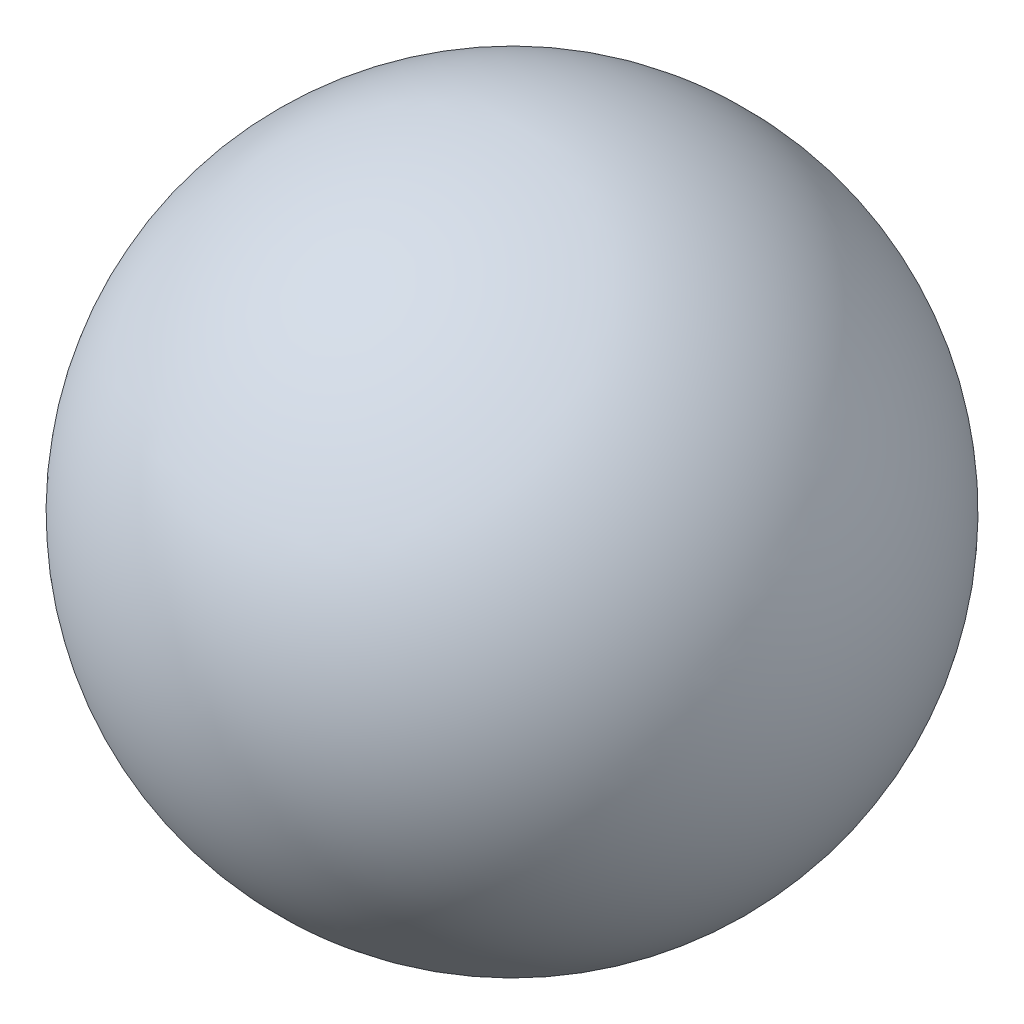
ISO-10303-21;
HEADER;
FILE_DESCRIPTION(('STEP AP214'),'2;1');
FILE_NAME('part.step','',(''),(''),'','','');
FILE_SCHEMA(('AUTOMOTIVE_DESIGN { 1 0 10303 214 1 1 1 1 }'));
ENDSEC;
DATA;
#1=APPLICATION_CONTEXT('core data for automotive mechanical design processes');
#2=APPLICATION_PROTOCOL_DEFINITION('international standard','automotive_design',2000,#1);
#3=PRODUCT_CONTEXT('',#1,'mechanical');
#4=PRODUCT('Part','Part','',(#3));
#5=PRODUCT_RELATED_PRODUCT_CATEGORY('part','',(#4));
#6=PRODUCT_DEFINITION_FORMATION('','',#4);
#7=PRODUCT_DEFINITION_CONTEXT('part definition',#1,'design');
#8=PRODUCT_DEFINITION('design','',#6,#7);
#9=PRODUCT_DEFINITION_SHAPE('','',#8);
#10=(LENGTH_UNIT() NAMED_UNIT(*) SI_UNIT(.MILLI.,.METRE.));
#11=(NAMED_UNIT(*) PLANE_ANGLE_UNIT() SI_UNIT($,.RADIAN.));
#12=(NAMED_UNIT(*) SI_UNIT($,.STERADIAN.) SOLID_ANGLE_UNIT());
#13=UNCERTAINTY_MEASURE_WITH_UNIT(LENGTH_MEASURE(1.E-05),#10,'distance_accuracy_value','');
#14=(GEOMETRIC_REPRESENTATION_CONTEXT(3) GLOBAL_UNCERTAINTY_ASSIGNED_CONTEXT((#13)) GLOBAL_UNIT_ASSIGNED_CONTEXT((#10,
#11,#12)) REPRESENTATION_CONTEXT('',''));
#15=CARTESIAN_POINT('',(0.,0.,0.));
#16=DIRECTION('',(0.,0.,1.));
#17=DIRECTION('',(1.,0.,0.));
#18=AXIS2_PLACEMENT_3D('',#15,#16,#17);
#19=CARTESIAN_POINT('',(64.16,-57.0308282276943,39.5156338765206));
#20=DIRECTION('',(0.,-0.821971206602399,0.569529047122792));
#21=DIRECTION('',(0.173648177666934,-0.560876621172181,-0.809483617014842));
#22=AXIS2_PLACEMENT_3D('',#19,#20,#21);
#23=SPHERICAL_SURFACE('',#22,7.15);
#24=CARTESIAN_POINT('',(64.16,-51.1537341004871,35.4435011895926));
#25=VERTEX_POINT('',#24);
#26=VERTEX_LOOP('',#25);
#27=FACE_BOUND('',#26,.T.);
#28=CARTESIAN_POINT('',(64.16,-62.9079223549014,43.5877665634486));
#29=VERTEX_POINT('',#28);
#30=VERTEX_LOOP('',#29);
#31=FACE_BOUND('',#30,.T.);
#32=ADVANCED_FACE('F15',(#27,#31),#23,.T.);
#33=CLOSED_SHELL('',(#32));
#34=MANIFOLD_SOLID_BREP('B1',#33);
#35=ADVANCED_BREP_SHAPE_REPRESENTATION('',(#18,#34),#14);
#36=SHAPE_DEFINITION_REPRESENTATION(#9,#35);
ENDSEC;
END-ISO-10303-21;
